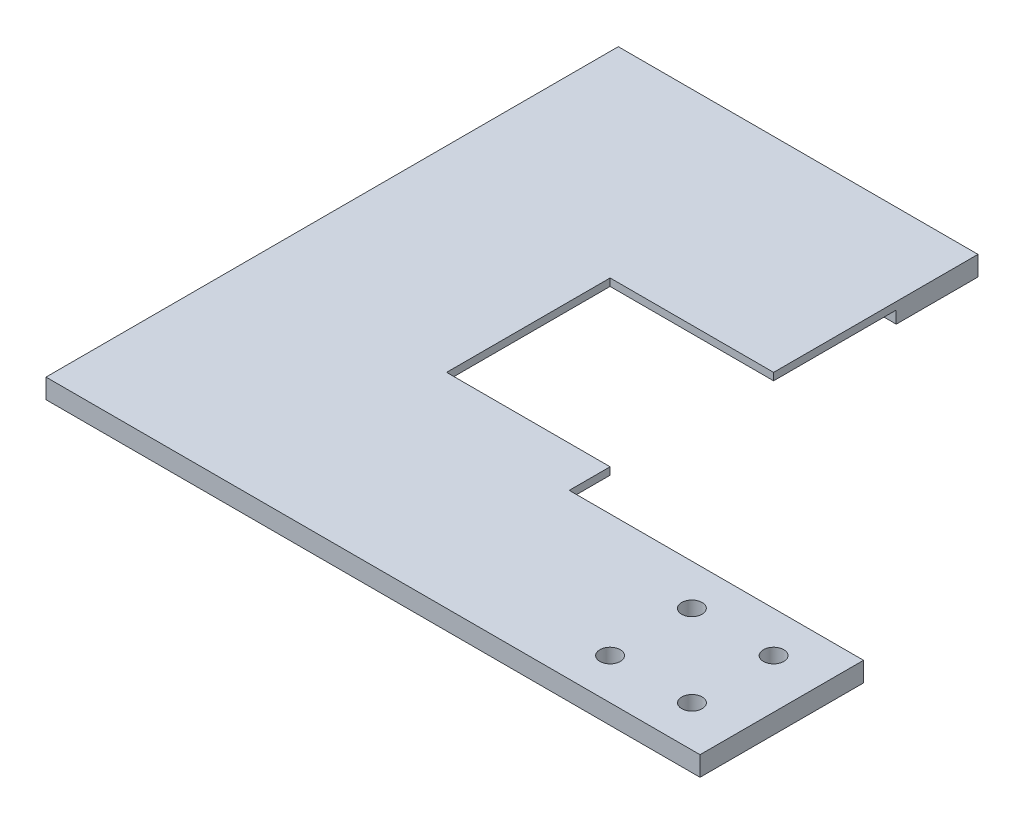
ISO-10303-21;
HEADER;
FILE_DESCRIPTION(('STEP AP214'),'2;1');
FILE_NAME('part.step','',(''),(''),'','','');
FILE_SCHEMA(('AUTOMOTIVE_DESIGN { 1 0 10303 214 1 1 1 1 }'));
ENDSEC;
DATA;
#1=APPLICATION_CONTEXT('core data for automotive mechanical design processes');
#2=APPLICATION_PROTOCOL_DEFINITION('international standard','automotive_design',2000,#1);
#3=PRODUCT_CONTEXT('',#1,'mechanical');
#4=PRODUCT('Part','Part','',(#3));
#5=PRODUCT_RELATED_PRODUCT_CATEGORY('part','',(#4));
#6=PRODUCT_DEFINITION_FORMATION('','',#4);
#7=PRODUCT_DEFINITION_CONTEXT('part definition',#1,'design');
#8=PRODUCT_DEFINITION('design','',#6,#7);
#9=PRODUCT_DEFINITION_SHAPE('','',#8);
#10=(LENGTH_UNIT() NAMED_UNIT(*) SI_UNIT(.MILLI.,.METRE.));
#11=(NAMED_UNIT(*) PLANE_ANGLE_UNIT() SI_UNIT($,.RADIAN.));
#12=(NAMED_UNIT(*) SI_UNIT($,.STERADIAN.) SOLID_ANGLE_UNIT());
#13=UNCERTAINTY_MEASURE_WITH_UNIT(LENGTH_MEASURE(1.E-05),#10,'distance_accuracy_value','');
#14=(GEOMETRIC_REPRESENTATION_CONTEXT(3) GLOBAL_UNCERTAINTY_ASSIGNED_CONTEXT((#13)) GLOBAL_UNIT_ASSIGNED_CONTEXT((#10,
#11,#12)) REPRESENTATION_CONTEXT('',''));
#15=CARTESIAN_POINT('',(0.,0.,0.));
#16=DIRECTION('',(0.,0.,1.));
#17=DIRECTION('',(1.,0.,0.));
#18=AXIS2_PLACEMENT_3D('',#15,#16,#17);
#19=CARTESIAN_POINT('',(-142.24,-6.096,-114.3));
#20=DIRECTION('',(1.,0.,0.));
#21=DIRECTION('',(0.,0.,-1.));
#22=AXIS2_PLACEMENT_3D('',#19,#20,#21);
#23=PLANE('',#22);
#24=DIRECTION('',(0.,1.,0.));
#25=VECTOR('',#24,1.);
#26=CARTESIAN_POINT('',(-142.24,-6.096,-63.5));
#27=LINE('',#26,#25);
#28=CARTESIAN_POINT('',(-142.24,-2.286,-63.5));
#29=VERTEX_POINT('',#28);
#30=CARTESIAN_POINT('',(-142.24,0.,-63.5));
#31=VERTEX_POINT('',#30);
#32=EDGE_CURVE('E364',#29,#31,#27,.T.);
#33=ORIENTED_EDGE('',*,*,#32,.F.);
#34=DIRECTION('',(0.,0.,-1.));
#35=VECTOR('',#34,1.);
#36=CARTESIAN_POINT('',(-142.24,-2.286,-114.3));
#37=LINE('',#36,#35);
#38=CARTESIAN_POINT('',(-142.24,-2.286,-114.3));
#39=VERTEX_POINT('',#38);
#40=EDGE_CURVE('E241',#29,#39,#37,.T.);
#41=ORIENTED_EDGE('',*,*,#40,.T.);
#42=DIRECTION('',(0.,1.,0.));
#43=VECTOR('',#42,1.);
#44=CARTESIAN_POINT('',(-142.24,-6.096,-114.3));
#45=LINE('',#44,#43);
#46=CARTESIAN_POINT('',(-142.24,0.,-114.3));
#47=VERTEX_POINT('',#46);
#48=EDGE_CURVE('E362',#39,#47,#45,.T.);
#49=ORIENTED_EDGE('',*,*,#48,.T.);
#50=DIRECTION('',(0.,0.,-1.));
#51=VECTOR('',#50,1.);
#52=CARTESIAN_POINT('',(-142.24,0.,-114.3));
#53=LINE('',#52,#51);
#54=EDGE_CURVE('E333',#31,#47,#53,.T.);
#55=ORIENTED_EDGE('',*,*,#54,.F.);
#56=EDGE_LOOP('',(#33,#41,#49,#55));
#57=FACE_BOUND('',#56,.T.);
#58=ADVANCED_FACE('F45',(#57),#23,.T.);
#59=CARTESIAN_POINT('',(-142.24,-6.096,-114.3));
#60=DIRECTION('',(0.,0.,1.));
#61=DIRECTION('',(1.,0.,0.));
#62=AXIS2_PLACEMENT_3D('',#59,#60,#61);
#63=PLANE('',#62);
#64=ORIENTED_EDGE('',*,*,#48,.F.);
#65=DIRECTION('',(1.,0.,0.));
#66=VECTOR('',#65,1.);
#67=CARTESIAN_POINT('',(-142.24,-2.286,-114.3));
#68=LINE('',#67,#66);
#69=CARTESIAN_POINT('',(-91.44,-2.286,-114.3));
#70=VERTEX_POINT('',#69);
#71=EDGE_CURVE('E244',#39,#70,#68,.T.);
#72=ORIENTED_EDGE('',*,*,#71,.T.);
#73=DIRECTION('',(0.,1.,0.));
#74=VECTOR('',#73,1.);
#75=CARTESIAN_POINT('',(-91.44,-6.096,-114.3));
#76=LINE('',#75,#74);
#77=CARTESIAN_POINT('',(-91.44,0.,-114.3));
#78=VERTEX_POINT('',#77);
#79=EDGE_CURVE('E360',#70,#78,#76,.T.);
#80=ORIENTED_EDGE('',*,*,#79,.T.);
#81=DIRECTION('',(1.,0.,0.));
#82=VECTOR('',#81,1.);
#83=CARTESIAN_POINT('',(-142.24,0.,-114.3));
#84=LINE('',#83,#82);
#85=EDGE_CURVE('E336',#47,#78,#84,.T.);
#86=ORIENTED_EDGE('',*,*,#85,.F.);
#87=EDGE_LOOP('',(#64,#72,#80,#86));
#88=FACE_BOUND('',#87,.T.);
#89=ADVANCED_FACE('F398',(#88),#63,.T.);
#90=CARTESIAN_POINT('',(-142.24,-6.096,-63.5));
#91=DIRECTION('',(0.,0.,-1.));
#92=DIRECTION('',(-1.,0.,0.));
#93=AXIS2_PLACEMENT_3D('',#90,#91,#92);
#94=PLANE('',#93);
#95=DIRECTION('',(0.,1.,0.));
#96=VECTOR('',#95,1.);
#97=CARTESIAN_POINT('',(-91.44,-6.096,-63.5));
#98=LINE('',#97,#96);
#99=CARTESIAN_POINT('',(-91.44,-2.286,-63.5));
#100=VERTEX_POINT('',#99);
#101=CARTESIAN_POINT('',(-91.44,0.,-63.5));
#102=VERTEX_POINT('',#101);
#103=EDGE_CURVE('E366',#100,#102,#98,.T.);
#104=ORIENTED_EDGE('',*,*,#103,.F.);
#105=DIRECTION('',(-1.,0.,0.));
#106=VECTOR('',#105,1.);
#107=CARTESIAN_POINT('',(-142.24,-2.286,-63.5));
#108=LINE('',#107,#106);
#109=EDGE_CURVE('E238',#100,#29,#108,.T.);
#110=ORIENTED_EDGE('',*,*,#109,.T.);
#111=ORIENTED_EDGE('',*,*,#32,.T.);
#112=DIRECTION('',(-1.,0.,0.));
#113=VECTOR('',#112,1.);
#114=CARTESIAN_POINT('',(-142.24,0.,-63.5));
#115=LINE('',#114,#113);
#116=EDGE_CURVE('E330',#102,#31,#115,.T.);
#117=ORIENTED_EDGE('',*,*,#116,.F.);
#118=EDGE_LOOP('',(#104,#110,#111,#117));
#119=FACE_BOUND('',#118,.T.);
#120=ADVANCED_FACE('F406',(#119),#94,.T.);
#121=CARTESIAN_POINT('',(-91.44,-6.096,-50.8));
#122=DIRECTION('',(1.,0.,0.));
#123=DIRECTION('',(0.,0.,-1.));
#124=AXIS2_PLACEMENT_3D('',#121,#122,#123);
#125=PLANE('',#124);
#126=DIRECTION('',(0.,1.,0.));
#127=VECTOR('',#126,1.);
#128=CARTESIAN_POINT('',(-91.44,-6.096,-50.8));
#129=LINE('',#128,#127);
#130=CARTESIAN_POINT('',(-91.44,-2.286,-50.8));
#131=VERTEX_POINT('',#130);
#132=CARTESIAN_POINT('',(-91.44,0.,-50.8));
#133=VERTEX_POINT('',#132);
#134=EDGE_CURVE('E368',#131,#133,#129,.T.);
#135=ORIENTED_EDGE('',*,*,#134,.F.);
#136=DIRECTION('',(0.,0.,1.));
#137=VECTOR('',#136,1.);
#138=CARTESIAN_POINT('',(-91.44,-2.286,-50.8));
#139=LINE('',#138,#137);
#140=EDGE_CURVE('E202',#100,#131,#139,.T.);
#141=ORIENTED_EDGE('',*,*,#140,.F.);
#142=ORIENTED_EDGE('',*,*,#103,.T.);
#143=DIRECTION('',(0.,0.,-1.));
#144=VECTOR('',#143,1.);
#145=CARTESIAN_POINT('',(-91.44,0.,-50.8));
#146=LINE('',#145,#144);
#147=EDGE_CURVE('E327',#133,#102,#146,.T.);
#148=ORIENTED_EDGE('',*,*,#147,.F.);
#149=EDGE_LOOP('',(#135,#141,#142,#148));
#150=FACE_BOUND('',#149,.T.);
#151=ADVANCED_FACE('F411',(#150),#125,.T.);
#152=CARTESIAN_POINT('',(0.,-6.096,0.));
#153=DIRECTION('',(1.,0.,0.));
#154=DIRECTION('',(0.,0.,-1.));
#155=AXIS2_PLACEMENT_3D('',#152,#153,#154);
#156=PLANE('',#155);
#157=DIRECTION('',(0.,0.,-1.));
#158=VECTOR('',#157,1.);
#159=CARTESIAN_POINT('',(0.,0.,0.));
#160=LINE('',#159,#158);
#161=CARTESIAN_POINT('',(0.,0.,0.));
#162=VERTEX_POINT('',#161);
#163=CARTESIAN_POINT('',(0.,0.,-50.8));
#164=VERTEX_POINT('',#163);
#165=EDGE_CURVE('E301',#162,#164,#160,.T.);
#166=ORIENTED_EDGE('',*,*,#165,.F.);
#167=DIRECTION('',(0.,1.,0.));
#168=VECTOR('',#167,1.);
#169=CARTESIAN_POINT('',(0.,-6.096,0.));
#170=LINE('',#169,#168);
#171=CARTESIAN_POINT('',(0.,-6.096,0.));
#172=VERTEX_POINT('',#171);
#173=EDGE_CURVE('E350',#172,#162,#170,.T.);
#174=ORIENTED_EDGE('',*,*,#173,.F.);
#175=DIRECTION('',(0.,0.,-1.));
#176=VECTOR('',#175,1.);
#177=CARTESIAN_POINT('',(0.,-6.096,0.));
#178=LINE('',#177,#176);
#179=CARTESIAN_POINT('',(0.,-6.096,-50.8));
#180=VERTEX_POINT('',#179);
#181=EDGE_CURVE('E304',#172,#180,#178,.T.);
#182=ORIENTED_EDGE('',*,*,#181,.T.);
#183=DIRECTION('',(0.,1.,0.));
#184=VECTOR('',#183,1.);
#185=CARTESIAN_POINT('',(0.,-6.096,-50.8));
#186=LINE('',#185,#184);
#187=EDGE_CURVE('E321',#180,#164,#186,.T.);
#188=ORIENTED_EDGE('',*,*,#187,.T.);
#189=EDGE_LOOP('',(#166,#174,#182,#188));
#190=FACE_BOUND('',#189,.T.);
#191=ADVANCED_FACE('F47',(#190),#156,.T.);
#192=CARTESIAN_POINT('',(0.,-6.096,0.));
#193=DIRECTION('',(0.,0.,1.));
#194=DIRECTION('',(1.,0.,0.));
#195=AXIS2_PLACEMENT_3D('',#192,#193,#194);
#196=PLANE('',#195);
#197=DIRECTION('',(1.,0.,0.));
#198=VECTOR('',#197,1.);
#199=CARTESIAN_POINT('',(0.,0.,0.));
#200=LINE('',#199,#198);
#201=CARTESIAN_POINT('',(-203.2,0.,0.));
#202=VERTEX_POINT('',#201);
#203=EDGE_CURVE('E308',#202,#162,#200,.T.);
#204=ORIENTED_EDGE('',*,*,#203,.F.);
#205=DIRECTION('',(0.,1.,0.));
#206=VECTOR('',#205,1.);
#207=CARTESIAN_POINT('',(-203.2,-6.096,0.));
#208=LINE('',#207,#206);
#209=CARTESIAN_POINT('',(-203.2,-6.096,0.));
#210=VERTEX_POINT('',#209);
#211=EDGE_CURVE('E353',#210,#202,#208,.T.);
#212=ORIENTED_EDGE('',*,*,#211,.F.);
#213=DIRECTION('',(1.,0.,0.));
#214=VECTOR('',#213,1.);
#215=CARTESIAN_POINT('',(0.,-6.096,0.));
#216=LINE('',#215,#214);
#217=EDGE_CURVE('E318',#210,#172,#216,.T.);
#218=ORIENTED_EDGE('',*,*,#217,.T.);
#219=ORIENTED_EDGE('',*,*,#173,.T.);
#220=EDGE_LOOP('',(#204,#212,#218,#219));
#221=FACE_BOUND('',#220,.T.);
#222=ADVANCED_FACE('F472',(#221),#196,.T.);
#223=CARTESIAN_POINT('',(-203.2,-6.096,0.));
#224=DIRECTION('',(-1.,0.,0.));
#225=DIRECTION('',(0.,0.,1.));
#226=AXIS2_PLACEMENT_3D('',#223,#224,#225);
#227=PLANE('',#226);
#228=DIRECTION('',(0.,0.,1.));
#229=VECTOR('',#228,1.);
#230=CARTESIAN_POINT('',(-203.2,0.,0.));
#231=LINE('',#230,#229);
#232=CARTESIAN_POINT('',(-203.2,0.,-177.8));
#233=VERTEX_POINT('',#232);
#234=EDGE_CURVE('E345',#233,#202,#231,.T.);
#235=ORIENTED_EDGE('',*,*,#234,.F.);
#236=DIRECTION('',(0.,1.,0.));
#237=VECTOR('',#236,1.);
#238=CARTESIAN_POINT('',(-203.2,-6.096,-177.8));
#239=LINE('',#238,#237);
#240=CARTESIAN_POINT('',(-203.2,-6.096,-177.8));
#241=VERTEX_POINT('',#240);
#242=EDGE_CURVE('E354',#241,#233,#239,.T.);
#243=ORIENTED_EDGE('',*,*,#242,.F.);
#244=DIRECTION('',(0.,0.,1.));
#245=VECTOR('',#244,1.);
#246=CARTESIAN_POINT('',(-203.2,-6.096,0.));
#247=LINE('',#246,#245);
#248=EDGE_CURVE('E315',#241,#210,#247,.T.);
#249=ORIENTED_EDGE('',*,*,#248,.T.);
#250=ORIENTED_EDGE('',*,*,#211,.T.);
#251=EDGE_LOOP('',(#235,#243,#249,#250));
#252=FACE_BOUND('',#251,.T.);
#253=ADVANCED_FACE('F466',(#252),#227,.T.);
#254=CARTESIAN_POINT('',(-91.44,-6.096,-177.8));
#255=DIRECTION('',(0.,0.,-1.));
#256=DIRECTION('',(-1.,0.,0.));
#257=AXIS2_PLACEMENT_3D('',#254,#255,#256);
#258=PLANE('',#257);
#259=DIRECTION('',(-1.,0.,0.));
#260=VECTOR('',#259,1.);
#261=CARTESIAN_POINT('',(-91.44,0.,-177.8));
#262=LINE('',#261,#260);
#263=CARTESIAN_POINT('',(-91.44,0.,-177.8));
#264=VERTEX_POINT('',#263);
#265=EDGE_CURVE('E342',#264,#233,#262,.T.);
#266=ORIENTED_EDGE('',*,*,#265,.F.);
#267=DIRECTION('',(0.,1.,0.));
#268=VECTOR('',#267,1.);
#269=CARTESIAN_POINT('',(-91.44,-6.096,-177.8));
#270=LINE('',#269,#268);
#271=CARTESIAN_POINT('',(-91.44,-6.096,-177.8));
#272=VERTEX_POINT('',#271);
#273=EDGE_CURVE('E358',#272,#264,#270,.T.);
#274=ORIENTED_EDGE('',*,*,#273,.F.);
#275=DIRECTION('',(-1.,0.,0.));
#276=VECTOR('',#275,1.);
#277=CARTESIAN_POINT('',(-91.44,-6.096,-177.8));
#278=LINE('',#277,#276);
#279=EDGE_CURVE('E312',#272,#241,#278,.T.);
#280=ORIENTED_EDGE('',*,*,#279,.T.);
#281=ORIENTED_EDGE('',*,*,#242,.T.);
#282=EDGE_LOOP('',(#266,#274,#280,#281));
#283=FACE_BOUND('',#282,.T.);
#284=ADVANCED_FACE('F462',(#283),#258,.T.);
#285=CARTESIAN_POINT('',(-91.44,-6.096,-114.3));
#286=DIRECTION('',(1.,0.,0.));
#287=DIRECTION('',(0.,0.,-1.));
#288=AXIS2_PLACEMENT_3D('',#285,#286,#287);
#289=PLANE('',#288);
#290=DIRECTION('',(0.,-1.,0.));
#291=VECTOR('',#290,1.);
#292=CARTESIAN_POINT('',(-91.44,-2.286,-152.4));
#293=LINE('',#292,#291);
#294=CARTESIAN_POINT('',(-91.44,-2.286,-152.4));
#295=VERTEX_POINT('',#294);
#296=CARTESIAN_POINT('',(-91.44,-6.096,-152.4));
#297=VERTEX_POINT('',#296);
#298=EDGE_CURVE('E193',#295,#297,#293,.T.);
#299=ORIENTED_EDGE('',*,*,#298,.T.);
#300=DIRECTION('',(0.,0.,-1.));
#301=VECTOR('',#300,1.);
#302=CARTESIAN_POINT('',(-91.44,-6.096,-114.3));
#303=LINE('',#302,#301);
#304=EDGE_CURVE('E310',#297,#272,#303,.T.);
#305=ORIENTED_EDGE('',*,*,#304,.T.);
#306=ORIENTED_EDGE('',*,*,#273,.T.);
#307=DIRECTION('',(0.,0.,-1.));
#308=VECTOR('',#307,1.);
#309=CARTESIAN_POINT('',(-91.44,0.,-114.3));
#310=LINE('',#309,#308);
#311=EDGE_CURVE('E339',#78,#264,#310,.T.);
#312=ORIENTED_EDGE('',*,*,#311,.F.);
#313=ORIENTED_EDGE('',*,*,#79,.F.);
#314=EDGE_CURVE('E212',#295,#70,#139,.T.);
#315=ORIENTED_EDGE('',*,*,#314,.F.);
#316=EDGE_LOOP('',(#299,#305,#306,#312,#313,#315));
#317=FACE_BOUND('',#316,.T.);
#318=ADVANCED_FACE('F392',(#317),#289,.T.);
#319=CARTESIAN_POINT('',(0.,-6.096,-50.8));
#320=DIRECTION('',(0.,0.,-1.));
#321=DIRECTION('',(-1.,0.,0.));
#322=AXIS2_PLACEMENT_3D('',#319,#320,#321);
#323=PLANE('',#322);
#324=DIRECTION('',(-1.,0.,0.));
#325=VECTOR('',#324,1.);
#326=CARTESIAN_POINT('',(0.,0.,-50.8));
#327=LINE('',#326,#325);
#328=EDGE_CURVE('E324',#164,#133,#327,.T.);
#329=ORIENTED_EDGE('',*,*,#328,.F.);
#330=ORIENTED_EDGE('',*,*,#187,.F.);
#331=DIRECTION('',(-1.,0.,0.));
#332=VECTOR('',#331,1.);
#333=CARTESIAN_POINT('',(0.,-6.096,-50.8));
#334=LINE('',#333,#332);
#335=CARTESIAN_POINT('',(-94.0604962171534,-6.096,-50.8));
#336=VERTEX_POINT('',#335);
#337=EDGE_CURVE('E307',#180,#336,#334,.T.);
#338=ORIENTED_EDGE('',*,*,#337,.T.);
#339=DIRECTION('',(0.,-1.,0.));
#340=VECTOR('',#339,1.);
#341=CARTESIAN_POINT('',(-94.0604962171534,-2.286,-50.8));
#342=LINE('',#341,#340);
#343=CARTESIAN_POINT('',(-94.0604962171534,-2.286,-50.8));
#344=VERTEX_POINT('',#343);
#345=EDGE_CURVE('E229',#344,#336,#342,.T.);
#346=ORIENTED_EDGE('',*,*,#345,.F.);
#347=DIRECTION('',(-1.,0.,0.));
#348=VECTOR('',#347,1.);
#349=CARTESIAN_POINT('',(-91.44,-2.286,-50.8));
#350=LINE('',#349,#348);
#351=EDGE_CURVE('E214',#131,#344,#350,.T.);
#352=ORIENTED_EDGE('',*,*,#351,.F.);
#353=ORIENTED_EDGE('',*,*,#134,.T.);
#354=EDGE_LOOP('',(#329,#330,#338,#346,#352,#353));
#355=FACE_BOUND('',#354,.T.);
#356=ADVANCED_FACE('F415',(#355),#323,.T.);
#357=CARTESIAN_POINT('',(0.,-6.096,-50.8));
#358=DIRECTION('',(0.,1.,0.));
#359=DIRECTION('',(0.,0.,1.));
#360=AXIS2_PLACEMENT_3D('',#357,#358,#359);
#361=PLANE('',#360);
#362=CARTESIAN_POINT('',(-15.2008359834994,-6.096,-12.7));
#363=DIRECTION('',(0.,1.,0.));
#364=DIRECTION('',(0.,0.,1.));
#365=AXIS2_PLACEMENT_3D('',#362,#363,#364);
#366=CIRCLE('',#365,3.175);
#367=CARTESIAN_POINT('',(-15.2008359834994,-6.096,-9.525));
#368=VERTEX_POINT('',#367);
#369=EDGE_CURVE('E280',#368,#368,#366,.T.);
#370=ORIENTED_EDGE('',*,*,#369,.T.);
#371=EDGE_LOOP('',(#370));
#372=FACE_BOUND('',#371,.T.);
#373=CARTESIAN_POINT('',(-40.64,-6.096,-12.7));
#374=DIRECTION('',(0.,1.,0.));
#375=DIRECTION('',(0.,0.,1.));
#376=AXIS2_PLACEMENT_3D('',#373,#374,#375);
#377=CIRCLE('',#376,3.175);
#378=CARTESIAN_POINT('',(-40.64,-6.096,-9.525));
#379=VERTEX_POINT('',#378);
#380=EDGE_CURVE('E286',#379,#379,#377,.T.);
#381=ORIENTED_EDGE('',*,*,#380,.T.);
#382=EDGE_LOOP('',(#381));
#383=FACE_BOUND('',#382,.T.);
#384=CARTESIAN_POINT('',(-40.64,-6.096,-38.1));
#385=DIRECTION('',(0.,1.,0.));
#386=DIRECTION('',(0.,0.,1.));
#387=AXIS2_PLACEMENT_3D('',#384,#385,#386);
#388=CIRCLE('',#387,3.175);
#389=CARTESIAN_POINT('',(-40.64,-6.096,-34.925));
#390=VERTEX_POINT('',#389);
#391=EDGE_CURVE('E292',#390,#390,#388,.T.);
#392=ORIENTED_EDGE('',*,*,#391,.T.);
#393=EDGE_LOOP('',(#392));
#394=FACE_BOUND('',#393,.T.);
#395=CARTESIAN_POINT('',(-15.24,-6.096,-38.1));
#396=DIRECTION('',(0.,1.,0.));
#397=DIRECTION('',(0.,0.,1.));
#398=AXIS2_PLACEMENT_3D('',#395,#396,#397);
#399=CIRCLE('',#398,3.175);
#400=CARTESIAN_POINT('',(-15.24,-6.096,-34.925));
#401=VERTEX_POINT('',#400);
#402=EDGE_CURVE('E298',#401,#401,#399,.T.);
#403=ORIENTED_EDGE('',*,*,#402,.T.);
#404=EDGE_LOOP('',(#403));
#405=FACE_BOUND('',#404,.T.);
#406=DIRECTION('',(0.,0.,-1.));
#407=VECTOR('',#406,1.);
#408=CARTESIAN_POINT('',(-99.06,-6.096,-50.8));
#409=LINE('',#408,#407);
#410=CARTESIAN_POINT('',(-99.06,-6.096,-12.7));
#411=VERTEX_POINT('',#410);
#412=CARTESIAN_POINT('',(-99.06,-6.096,-25.4));
#413=VERTEX_POINT('',#412);
#414=EDGE_CURVE('E352',#411,#413,#409,.T.);
#415=ORIENTED_EDGE('',*,*,#414,.T.);
#416=DIRECTION('',(-1.,0.,0.));
#417=VECTOR('',#416,1.);
#418=CARTESIAN_POINT('',(-177.8,-6.096,-25.4));
#419=LINE('',#418,#417);
#420=CARTESIAN_POINT('',(-94.0604962171534,-6.096,-25.4));
#421=VERTEX_POINT('',#420);
#422=EDGE_CURVE('E207',#421,#413,#419,.T.);
#423=ORIENTED_EDGE('',*,*,#422,.F.);
#424=DIRECTION('',(0.,0.,1.));
#425=VECTOR('',#424,1.);
#426=CARTESIAN_POINT('',(-94.0604962171534,-6.096,-25.4));
#427=LINE('',#426,#425);
#428=EDGE_CURVE('E209',#336,#421,#427,.T.);
#429=ORIENTED_EDGE('',*,*,#428,.F.);
#430=ORIENTED_EDGE('',*,*,#337,.F.);
#431=ORIENTED_EDGE('',*,*,#181,.F.);
#432=ORIENTED_EDGE('',*,*,#217,.F.);
#433=ORIENTED_EDGE('',*,*,#248,.F.);
#434=ORIENTED_EDGE('',*,*,#279,.F.);
#435=ORIENTED_EDGE('',*,*,#304,.F.);
#436=DIRECTION('',(1.,0.,0.));
#437=VECTOR('',#436,1.);
#438=CARTESIAN_POINT('',(-177.8,-6.096,-152.4));
#439=LINE('',#438,#437);
#440=CARTESIAN_POINT('',(-99.06,-6.096,-152.4));
#441=VERTEX_POINT('',#440);
#442=EDGE_CURVE('E220',#441,#297,#439,.T.);
#443=ORIENTED_EDGE('',*,*,#442,.F.);
#444=DIRECTION('',(0.,0.,1.));
#445=VECTOR('',#444,1.);
#446=CARTESIAN_POINT('',(-99.06,-6.096,-12.7));
#447=LINE('',#446,#445);
#448=CARTESIAN_POINT('',(-99.06,-6.096,-165.1));
#449=VERTEX_POINT('',#448);
#450=EDGE_CURVE('E266',#449,#441,#447,.T.);
#451=ORIENTED_EDGE('',*,*,#450,.F.);
#452=DIRECTION('',(1.,0.,0.));
#453=VECTOR('',#452,1.);
#454=CARTESIAN_POINT('',(-190.5,-6.096,-165.1));
#455=LINE('',#454,#453);
#456=CARTESIAN_POINT('',(-190.5,-6.096,-165.1));
#457=VERTEX_POINT('',#456);
#458=EDGE_CURVE('E263',#457,#449,#455,.T.);
#459=ORIENTED_EDGE('',*,*,#458,.F.);
#460=DIRECTION('',(0.,0.,-1.));
#461=VECTOR('',#460,1.);
#462=CARTESIAN_POINT('',(-190.5,-6.096,-12.7));
#463=LINE('',#462,#461);
#464=CARTESIAN_POINT('',(-190.5,-6.096,-12.7));
#465=VERTEX_POINT('',#464);
#466=EDGE_CURVE('E68',#465,#457,#463,.T.);
#467=ORIENTED_EDGE('',*,*,#466,.F.);
#468=DIRECTION('',(-1.,0.,0.));
#469=VECTOR('',#468,1.);
#470=CARTESIAN_POINT('',(-190.5,-6.096,-12.7));
#471=LINE('',#470,#469);
#472=EDGE_CURVE('E251',#411,#465,#471,.T.);
#473=ORIENTED_EDGE('',*,*,#472,.F.);
#474=EDGE_LOOP('',(#415,#423,#429,#430,#431,#432,#433,#434,#435,#443,#451,#459,#467,#473));
#475=FACE_BOUND('',#474,.T.);
#476=ADVANCED_FACE('F388',(#372,#383,#394,#405,#475),#361,.F.);
#477=CARTESIAN_POINT('',(0.,0.,-50.8));
#478=DIRECTION('',(0.,1.,0.));
#479=DIRECTION('',(0.,0.,1.));
#480=AXIS2_PLACEMENT_3D('',#477,#478,#479);
#481=PLANE('',#480);
#482=CARTESIAN_POINT('',(-15.2008359834994,0.,-12.7));
#483=DIRECTION('',(0.,1.,0.));
#484=DIRECTION('',(0.,0.,1.));
#485=AXIS2_PLACEMENT_3D('',#482,#483,#484);
#486=CIRCLE('',#485,3.175);
#487=CARTESIAN_POINT('',(-15.2008359834994,0.,-9.525));
#488=VERTEX_POINT('',#487);
#489=EDGE_CURVE('E273',#488,#488,#486,.T.);
#490=ORIENTED_EDGE('',*,*,#489,.F.);
#491=EDGE_LOOP('',(#490));
#492=FACE_BOUND('',#491,.T.);
#493=CARTESIAN_POINT('',(-40.64,0.,-12.7));
#494=DIRECTION('',(0.,1.,0.));
#495=DIRECTION('',(0.,0.,1.));
#496=AXIS2_PLACEMENT_3D('',#493,#494,#495);
#497=CIRCLE('',#496,3.175);
#498=CARTESIAN_POINT('',(-40.64,0.,-9.525));
#499=VERTEX_POINT('',#498);
#500=EDGE_CURVE('E283',#499,#499,#497,.T.);
#501=ORIENTED_EDGE('',*,*,#500,.F.);
#502=EDGE_LOOP('',(#501));
#503=FACE_BOUND('',#502,.T.);
#504=CARTESIAN_POINT('',(-40.64,0.,-38.1));
#505=DIRECTION('',(0.,1.,0.));
#506=DIRECTION('',(0.,0.,1.));
#507=AXIS2_PLACEMENT_3D('',#504,#505,#506);
#508=CIRCLE('',#507,3.175);
#509=CARTESIAN_POINT('',(-40.64,0.,-34.925));
#510=VERTEX_POINT('',#509);
#511=EDGE_CURVE('E289',#510,#510,#508,.T.);
#512=ORIENTED_EDGE('',*,*,#511,.F.);
#513=EDGE_LOOP('',(#512));
#514=FACE_BOUND('',#513,.T.);
#515=CARTESIAN_POINT('',(-15.24,0.,-38.1));
#516=DIRECTION('',(0.,1.,0.));
#517=DIRECTION('',(0.,0.,1.));
#518=AXIS2_PLACEMENT_3D('',#515,#516,#517);
#519=CIRCLE('',#518,3.175);
#520=CARTESIAN_POINT('',(-15.24,0.,-34.925));
#521=VERTEX_POINT('',#520);
#522=EDGE_CURVE('E295',#521,#521,#519,.T.);
#523=ORIENTED_EDGE('',*,*,#522,.F.);
#524=EDGE_LOOP('',(#523));
#525=FACE_BOUND('',#524,.T.);
#526=ORIENTED_EDGE('',*,*,#165,.T.);
#527=ORIENTED_EDGE('',*,*,#328,.T.);
#528=ORIENTED_EDGE('',*,*,#147,.T.);
#529=ORIENTED_EDGE('',*,*,#116,.T.);
#530=ORIENTED_EDGE('',*,*,#54,.T.);
#531=ORIENTED_EDGE('',*,*,#85,.T.);
#532=ORIENTED_EDGE('',*,*,#311,.T.);
#533=ORIENTED_EDGE('',*,*,#265,.T.);
#534=ORIENTED_EDGE('',*,*,#234,.T.);
#535=ORIENTED_EDGE('',*,*,#203,.T.);
#536=EDGE_LOOP('',(#526,#527,#528,#529,#530,#531,#532,#533,#534,#535));
#537=FACE_BOUND('',#536,.T.);
#538=ADVANCED_FACE('F459',(#492,#503,#514,#525,#537),#481,.T.);
#539=CARTESIAN_POINT('',(-15.24,-6.096,-38.1));
#540=DIRECTION('',(0.,1.,0.));
#541=DIRECTION('',(0.,0.,1.));
#542=AXIS2_PLACEMENT_3D('',#539,#540,#541);
#543=CYLINDRICAL_SURFACE('',#542,3.175);
#544=ORIENTED_EDGE('',*,*,#402,.F.);
#545=EDGE_LOOP('',(#544));
#546=FACE_BOUND('',#545,.T.);
#547=ORIENTED_EDGE('',*,*,#522,.T.);
#548=EDGE_LOOP('',(#547));
#549=FACE_BOUND('',#548,.T.);
#550=ADVANCED_FACE('F478',(#546,#549),#543,.F.);
#551=CARTESIAN_POINT('',(-40.64,-6.096,-38.1));
#552=DIRECTION('',(0.,1.,0.));
#553=DIRECTION('',(0.,0.,1.));
#554=AXIS2_PLACEMENT_3D('',#551,#552,#553);
#555=CYLINDRICAL_SURFACE('',#554,3.175);
#556=ORIENTED_EDGE('',*,*,#391,.F.);
#557=EDGE_LOOP('',(#556));
#558=FACE_BOUND('',#557,.T.);
#559=ORIENTED_EDGE('',*,*,#511,.T.);
#560=EDGE_LOOP('',(#559));
#561=FACE_BOUND('',#560,.T.);
#562=ADVANCED_FACE('F483',(#558,#561),#555,.F.);
#563=CARTESIAN_POINT('',(-40.64,-6.096,-12.7));
#564=DIRECTION('',(0.,1.,0.));
#565=DIRECTION('',(0.,0.,1.));
#566=AXIS2_PLACEMENT_3D('',#563,#564,#565);
#567=CYLINDRICAL_SURFACE('',#566,3.175);
#568=ORIENTED_EDGE('',*,*,#380,.F.);
#569=EDGE_LOOP('',(#568));
#570=FACE_BOUND('',#569,.T.);
#571=ORIENTED_EDGE('',*,*,#500,.T.);
#572=EDGE_LOOP('',(#571));
#573=FACE_BOUND('',#572,.T.);
#574=ADVANCED_FACE('F487',(#570,#573),#567,.F.);
#575=CARTESIAN_POINT('',(-15.2008359834994,-6.096,-12.7));
#576=DIRECTION('',(0.,1.,0.));
#577=DIRECTION('',(0.,0.,1.));
#578=AXIS2_PLACEMENT_3D('',#575,#576,#577);
#579=CYLINDRICAL_SURFACE('',#578,3.175);
#580=ORIENTED_EDGE('',*,*,#369,.F.);
#581=EDGE_LOOP('',(#580));
#582=FACE_BOUND('',#581,.T.);
#583=ORIENTED_EDGE('',*,*,#489,.T.);
#584=EDGE_LOOP('',(#583));
#585=FACE_BOUND('',#584,.T.);
#586=ADVANCED_FACE('F439',(#582,#585),#579,.F.);
#587=CARTESIAN_POINT('',(-99.06,-4.826,-12.7));
#588=DIRECTION('',(1.,0.,0.));
#589=DIRECTION('',(0.,0.,-1.));
#590=AXIS2_PLACEMENT_3D('',#587,#588,#589);
#591=PLANE('',#590);
#592=ORIENTED_EDGE('',*,*,#450,.T.);
#593=DIRECTION('',(0.,1.,0.));
#594=VECTOR('',#593,1.);
#595=CARTESIAN_POINT('',(-99.06,-4.826,-152.4));
#596=LINE('',#595,#594);
#597=CARTESIAN_POINT('',(-99.06,-4.826,-152.4));
#598=VERTEX_POINT('',#597);
#599=EDGE_CURVE('E226',#441,#598,#596,.T.);
#600=ORIENTED_EDGE('',*,*,#599,.T.);
#601=DIRECTION('',(0.,0.,1.));
#602=VECTOR('',#601,1.);
#603=CARTESIAN_POINT('',(-99.06,-4.826,-12.7));
#604=LINE('',#603,#602);
#605=CARTESIAN_POINT('',(-99.06,-4.826,-165.1));
#606=VERTEX_POINT('',#605);
#607=EDGE_CURVE('E255',#606,#598,#604,.T.);
#608=ORIENTED_EDGE('',*,*,#607,.F.);
#609=DIRECTION('',(0.,-1.,0.));
#610=VECTOR('',#609,1.);
#611=CARTESIAN_POINT('',(-99.06,-4.826,-165.1));
#612=LINE('',#611,#610);
#613=EDGE_CURVE('E277',#606,#449,#612,.T.);
#614=ORIENTED_EDGE('',*,*,#613,.T.);
#615=EDGE_LOOP('',(#592,#600,#608,#614));
#616=FACE_BOUND('',#615,.T.);
#617=ADVANCED_FACE('F378',(#616),#591,.F.);
#618=CARTESIAN_POINT('',(-190.5,-4.826,-12.7));
#619=DIRECTION('',(-1.,0.,0.));
#620=DIRECTION('',(0.,0.,1.));
#621=AXIS2_PLACEMENT_3D('',#618,#619,#620);
#622=PLANE('',#621);
#623=ORIENTED_EDGE('',*,*,#466,.T.);
#624=DIRECTION('',(0.,-1.,0.));
#625=VECTOR('',#624,1.);
#626=CARTESIAN_POINT('',(-190.5,-4.826,-165.1));
#627=LINE('',#626,#625);
#628=CARTESIAN_POINT('',(-190.5,-4.826,-165.1));
#629=VERTEX_POINT('',#628);
#630=EDGE_CURVE('E261',#629,#457,#627,.T.);
#631=ORIENTED_EDGE('',*,*,#630,.F.);
#632=DIRECTION('',(0.,0.,-1.));
#633=VECTOR('',#632,1.);
#634=CARTESIAN_POINT('',(-190.5,-4.826,-12.7));
#635=LINE('',#634,#633);
#636=CARTESIAN_POINT('',(-190.5,-4.826,-12.7));
#637=VERTEX_POINT('',#636);
#638=EDGE_CURVE('E247',#637,#629,#635,.T.);
#639=ORIENTED_EDGE('',*,*,#638,.F.);
#640=DIRECTION('',(0.,-1.,0.));
#641=VECTOR('',#640,1.);
#642=CARTESIAN_POINT('',(-190.5,-4.826,-12.7));
#643=LINE('',#642,#641);
#644=EDGE_CURVE('E271',#637,#465,#643,.T.);
#645=ORIENTED_EDGE('',*,*,#644,.T.);
#646=EDGE_LOOP('',(#623,#631,#639,#645));
#647=FACE_BOUND('',#646,.T.);
#648=ADVANCED_FACE('F431',(#647),#622,.F.);
#649=CARTESIAN_POINT('',(-190.5,-4.826,-12.7));
#650=DIRECTION('',(0.,0.,1.));
#651=DIRECTION('',(1.,0.,0.));
#652=AXIS2_PLACEMENT_3D('',#649,#650,#651);
#653=PLANE('',#652);
#654=ORIENTED_EDGE('',*,*,#472,.T.);
#655=ORIENTED_EDGE('',*,*,#644,.F.);
#656=DIRECTION('',(-1.,0.,0.));
#657=VECTOR('',#656,1.);
#658=CARTESIAN_POINT('',(-190.5,-4.826,-12.7));
#659=LINE('',#658,#657);
#660=CARTESIAN_POINT('',(-99.06,-4.826,-12.7));
#661=VERTEX_POINT('',#660);
#662=EDGE_CURVE('E258',#661,#637,#659,.T.);
#663=ORIENTED_EDGE('',*,*,#662,.F.);
#664=DIRECTION('',(0.,-1.,0.));
#665=VECTOR('',#664,1.);
#666=CARTESIAN_POINT('',(-99.06,-4.826,-12.7));
#667=LINE('',#666,#665);
#668=EDGE_CURVE('E274',#661,#411,#667,.T.);
#669=ORIENTED_EDGE('',*,*,#668,.T.);
#670=EDGE_LOOP('',(#654,#655,#663,#669));
#671=FACE_BOUND('',#670,.T.);
#672=ADVANCED_FACE('F430',(#671),#653,.F.);
#673=CARTESIAN_POINT('',(-99.06,-4.826,-25.4));
#674=VERTEX_POINT('',#673);
#675=EDGE_CURVE('E254',#674,#661,#604,.T.);
#676=ORIENTED_EDGE('',*,*,#675,.F.);
#677=DIRECTION('',(0.,-1.,0.));
#678=VECTOR('',#677,1.);
#679=CARTESIAN_POINT('',(-99.06,-4.826,-25.4));
#680=LINE('',#679,#678);
#681=EDGE_CURVE('E235',#674,#413,#680,.T.);
#682=ORIENTED_EDGE('',*,*,#681,.T.);
#683=ORIENTED_EDGE('',*,*,#414,.F.);
#684=ORIENTED_EDGE('',*,*,#668,.F.);
#685=EDGE_LOOP('',(#676,#682,#683,#684));
#686=FACE_BOUND('',#685,.T.);
#687=ADVANCED_FACE('F426',(#686),#591,.F.);
#688=CARTESIAN_POINT('',(-190.5,-4.826,-165.1));
#689=DIRECTION('',(0.,0.,-1.));
#690=DIRECTION('',(-1.,0.,0.));
#691=AXIS2_PLACEMENT_3D('',#688,#689,#690);
#692=PLANE('',#691);
#693=ORIENTED_EDGE('',*,*,#458,.T.);
#694=ORIENTED_EDGE('',*,*,#613,.F.);
#695=DIRECTION('',(1.,0.,0.));
#696=VECTOR('',#695,1.);
#697=CARTESIAN_POINT('',(-190.5,-4.826,-165.1));
#698=LINE('',#697,#696);
#699=EDGE_CURVE('E250',#629,#606,#698,.T.);
#700=ORIENTED_EDGE('',*,*,#699,.F.);
#701=ORIENTED_EDGE('',*,*,#630,.T.);
#702=EDGE_LOOP('',(#693,#694,#700,#701));
#703=FACE_BOUND('',#702,.T.);
#704=ADVANCED_FACE('F385',(#703),#692,.F.);
#705=CARTESIAN_POINT('',(-190.5,-4.826,-165.1));
#706=DIRECTION('',(0.,-1.,0.));
#707=DIRECTION('',(0.,0.,-1.));
#708=AXIS2_PLACEMENT_3D('',#705,#706,#707);
#709=PLANE('',#708);
#710=DIRECTION('',(-1.,0.,0.));
#711=VECTOR('',#710,1.);
#712=CARTESIAN_POINT('',(-190.5,-4.826,-25.4));
#713=LINE('',#712,#711);
#714=CARTESIAN_POINT('',(-177.8,-4.826,-25.4));
#715=VERTEX_POINT('',#714);
#716=EDGE_CURVE('E12',#674,#715,#713,.T.);
#717=ORIENTED_EDGE('',*,*,#716,.F.);
#718=ORIENTED_EDGE('',*,*,#675,.T.);
#719=ORIENTED_EDGE('',*,*,#662,.T.);
#720=ORIENTED_EDGE('',*,*,#638,.T.);
#721=ORIENTED_EDGE('',*,*,#699,.T.);
#722=ORIENTED_EDGE('',*,*,#607,.T.);
#723=DIRECTION('',(1.,0.,0.));
#724=VECTOR('',#723,1.);
#725=CARTESIAN_POINT('',(-190.5,-4.826,-152.4));
#726=LINE('',#725,#724);
#727=CARTESIAN_POINT('',(-177.8,-4.826,-152.4));
#728=VERTEX_POINT('',#727);
#729=EDGE_CURVE('E373',#728,#598,#726,.T.);
#730=ORIENTED_EDGE('',*,*,#729,.F.);
#731=DIRECTION('',(0.,0.,-1.));
#732=VECTOR('',#731,1.);
#733=CARTESIAN_POINT('',(-177.8,-4.826,-165.1));
#734=LINE('',#733,#732);
#735=EDGE_CURVE('E53',#715,#728,#734,.T.);
#736=ORIENTED_EDGE('',*,*,#735,.F.);
#737=EDGE_LOOP('',(#717,#718,#719,#720,#721,#722,#730,#736));
#738=FACE_BOUND('',#737,.T.);
#739=ADVANCED_FACE('F381',(#738),#709,.T.);
#740=CARTESIAN_POINT('',(-177.8,-2.286,-25.4));
#741=DIRECTION('',(0.,0.,1.));
#742=DIRECTION('',(1.,0.,0.));
#743=AXIS2_PLACEMENT_3D('',#740,#741,#742);
#744=PLANE('',#743);
#745=ORIENTED_EDGE('',*,*,#716,.T.);
#746=DIRECTION('',(0.,-1.,0.));
#747=VECTOR('',#746,1.);
#748=CARTESIAN_POINT('',(-177.8,-2.286,-25.4));
#749=LINE('',#748,#747);
#750=CARTESIAN_POINT('',(-177.8,-2.286,-25.4));
#751=VERTEX_POINT('',#750);
#752=EDGE_CURVE('E224',#751,#715,#749,.T.);
#753=ORIENTED_EDGE('',*,*,#752,.F.);
#754=DIRECTION('',(-1.,0.,0.));
#755=VECTOR('',#754,1.);
#756=CARTESIAN_POINT('',(-177.8,-2.286,-25.4));
#757=LINE('',#756,#755);
#758=CARTESIAN_POINT('',(-94.0604962171534,-2.286,-25.4));
#759=VERTEX_POINT('',#758);
#760=EDGE_CURVE('E194',#759,#751,#757,.T.);
#761=ORIENTED_EDGE('',*,*,#760,.F.);
#762=DIRECTION('',(0.,-1.,0.));
#763=VECTOR('',#762,1.);
#764=CARTESIAN_POINT('',(-94.0604962171534,-2.286,-25.4));
#765=LINE('',#764,#763);
#766=EDGE_CURVE('E227',#759,#421,#765,.T.);
#767=ORIENTED_EDGE('',*,*,#766,.T.);
#768=ORIENTED_EDGE('',*,*,#422,.T.);
#769=ORIENTED_EDGE('',*,*,#681,.F.);
#770=EDGE_LOOP('',(#745,#753,#761,#767,#768,#769));
#771=FACE_BOUND('',#770,.T.);
#772=ADVANCED_FACE('F422',(#771),#744,.F.);
#773=CARTESIAN_POINT('',(-177.8,-2.286,-152.4));
#774=DIRECTION('',(0.,0.,-1.));
#775=DIRECTION('',(-1.,0.,0.));
#776=AXIS2_PLACEMENT_3D('',#773,#774,#775);
#777=PLANE('',#776);
#778=ORIENTED_EDGE('',*,*,#442,.T.);
#779=ORIENTED_EDGE('',*,*,#298,.F.);
#780=DIRECTION('',(1.,0.,0.));
#781=VECTOR('',#780,1.);
#782=CARTESIAN_POINT('',(-177.8,-2.286,-152.4));
#783=LINE('',#782,#781);
#784=CARTESIAN_POINT('',(-177.8,-2.286,-152.4));
#785=VERTEX_POINT('',#784);
#786=EDGE_CURVE('E197',#785,#295,#783,.T.);
#787=ORIENTED_EDGE('',*,*,#786,.F.);
#788=DIRECTION('',(0.,-1.,0.));
#789=VECTOR('',#788,1.);
#790=CARTESIAN_POINT('',(-177.8,-2.286,-152.4));
#791=LINE('',#790,#789);
#792=EDGE_CURVE('E60',#785,#728,#791,.T.);
#793=ORIENTED_EDGE('',*,*,#792,.T.);
#794=ORIENTED_EDGE('',*,*,#729,.T.);
#795=ORIENTED_EDGE('',*,*,#599,.F.);
#796=EDGE_LOOP('',(#778,#779,#787,#793,#794,#795));
#797=FACE_BOUND('',#796,.T.);
#798=ADVANCED_FACE('F198',(#797),#777,.F.);
#799=CARTESIAN_POINT('',(-177.8,-2.286,-25.4));
#800=DIRECTION('',(-1.,0.,0.));
#801=DIRECTION('',(0.,0.,1.));
#802=AXIS2_PLACEMENT_3D('',#799,#800,#801);
#803=PLANE('',#802);
#804=ORIENTED_EDGE('',*,*,#735,.T.);
#805=ORIENTED_EDGE('',*,*,#792,.F.);
#806=DIRECTION('',(0.,0.,-1.));
#807=VECTOR('',#806,1.);
#808=CARTESIAN_POINT('',(-177.8,-2.286,-25.4));
#809=LINE('',#808,#807);
#810=EDGE_CURVE('E189',#751,#785,#809,.T.);
#811=ORIENTED_EDGE('',*,*,#810,.F.);
#812=ORIENTED_EDGE('',*,*,#752,.T.);
#813=EDGE_LOOP('',(#804,#805,#811,#812));
#814=FACE_BOUND('',#813,.T.);
#815=ADVANCED_FACE('F186',(#814),#803,.F.);
#816=CARTESIAN_POINT('',(-94.0604962171534,-2.286,-25.4));
#817=DIRECTION('',(1.,0.,0.));
#818=DIRECTION('',(0.,0.,-1.));
#819=AXIS2_PLACEMENT_3D('',#816,#817,#818);
#820=PLANE('',#819);
#821=ORIENTED_EDGE('',*,*,#428,.T.);
#822=ORIENTED_EDGE('',*,*,#766,.F.);
#823=DIRECTION('',(0.,0.,1.));
#824=VECTOR('',#823,1.);
#825=CARTESIAN_POINT('',(-94.0604962171534,-2.286,-25.4));
#826=LINE('',#825,#824);
#827=EDGE_CURVE('E217',#344,#759,#826,.T.);
#828=ORIENTED_EDGE('',*,*,#827,.F.);
#829=ORIENTED_EDGE('',*,*,#345,.T.);
#830=EDGE_LOOP('',(#821,#822,#828,#829));
#831=FACE_BOUND('',#830,.T.);
#832=ADVANCED_FACE('F420',(#831),#820,.F.);
#833=CARTESIAN_POINT('',(-177.8,-2.286,-152.4));
#834=DIRECTION('',(0.,-1.,0.));
#835=DIRECTION('',(0.,0.,-1.));
#836=AXIS2_PLACEMENT_3D('',#833,#834,#835);
#837=PLANE('',#836);
#838=ORIENTED_EDGE('',*,*,#40,.F.);
#839=ORIENTED_EDGE('',*,*,#109,.F.);
#840=ORIENTED_EDGE('',*,*,#140,.T.);
#841=ORIENTED_EDGE('',*,*,#351,.T.);
#842=ORIENTED_EDGE('',*,*,#827,.T.);
#843=ORIENTED_EDGE('',*,*,#760,.T.);
#844=ORIENTED_EDGE('',*,*,#810,.T.);
#845=ORIENTED_EDGE('',*,*,#786,.T.);
#846=ORIENTED_EDGE('',*,*,#314,.T.);
#847=ORIENTED_EDGE('',*,*,#71,.F.);
#848=EDGE_LOOP('',(#838,#839,#840,#841,#842,#843,#844,#845,#846,#847));
#849=FACE_BOUND('',#848,.T.);
#850=ADVANCED_FACE('F204',(#849),#837,.T.);
#851=CLOSED_SHELL('',(#58,#89,#120,#151,#191,#222,#253,#284,#318,#356,#476,#538,#550,#562,#574,
#586,#617,#648,#672,#687,#704,#739,#772,#798,#815,#832,#850));
#852=MANIFOLD_SOLID_BREP('B2',#851);
#853=ADVANCED_BREP_SHAPE_REPRESENTATION('',(#18,#852),#14);
#854=SHAPE_DEFINITION_REPRESENTATION(#9,#853);
ENDSEC;
END-ISO-10303-21;
